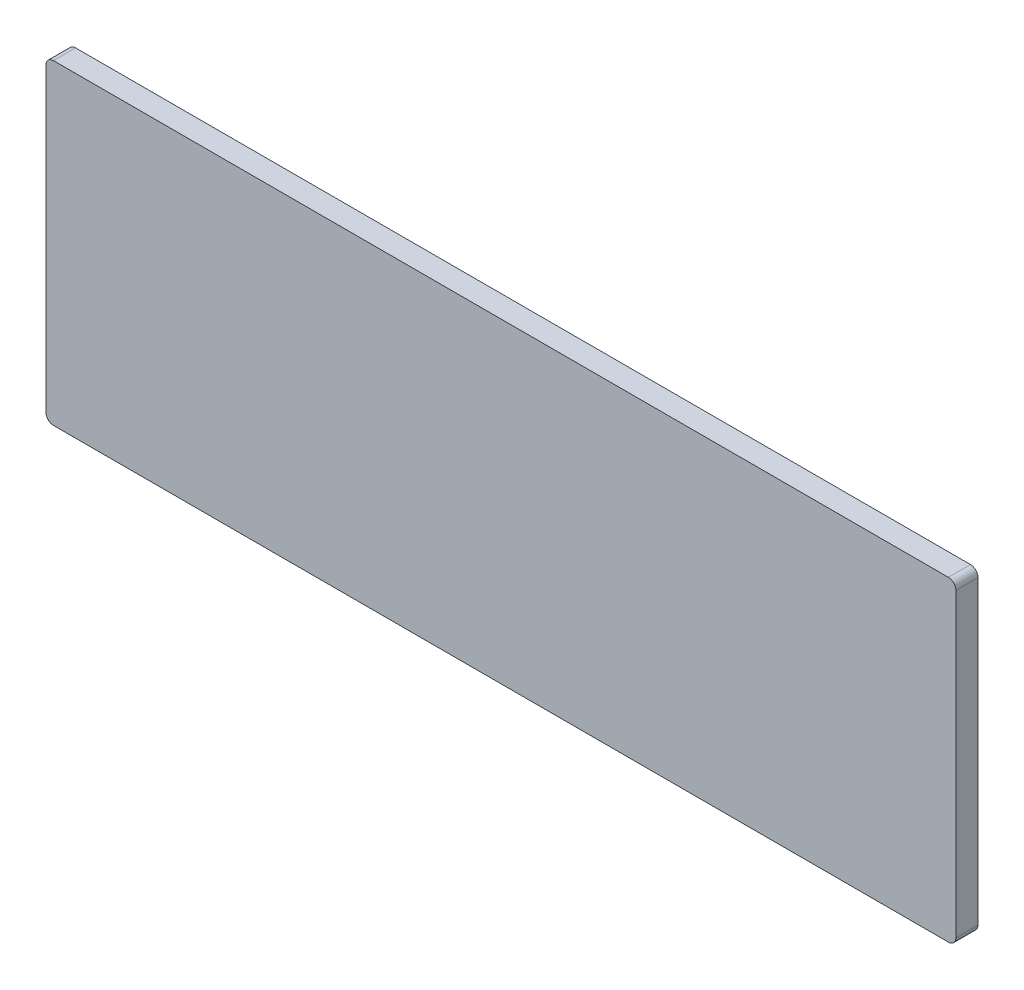
ISO-10303-21;
HEADER;
FILE_DESCRIPTION(('STEP AP214'),'2;1');
FILE_NAME('part.step','',(''),(''),'','','');
FILE_SCHEMA(('AUTOMOTIVE_DESIGN { 1 0 10303 214 1 1 1 1 }'));
ENDSEC;
DATA;
#1=APPLICATION_CONTEXT('core data for automotive mechanical design processes');
#2=APPLICATION_PROTOCOL_DEFINITION('international standard','automotive_design',2000,#1);
#3=PRODUCT_CONTEXT('',#1,'mechanical');
#4=PRODUCT('Part','Part','',(#3));
#5=PRODUCT_RELATED_PRODUCT_CATEGORY('part','',(#4));
#6=PRODUCT_DEFINITION_FORMATION('','',#4);
#7=PRODUCT_DEFINITION_CONTEXT('part definition',#1,'design');
#8=PRODUCT_DEFINITION('design','',#6,#7);
#9=PRODUCT_DEFINITION_SHAPE('','',#8);
#10=(LENGTH_UNIT() NAMED_UNIT(*) SI_UNIT(.MILLI.,.METRE.));
#11=(NAMED_UNIT(*) PLANE_ANGLE_UNIT() SI_UNIT($,.RADIAN.));
#12=(NAMED_UNIT(*) SI_UNIT($,.STERADIAN.) SOLID_ANGLE_UNIT());
#13=UNCERTAINTY_MEASURE_WITH_UNIT(LENGTH_MEASURE(1.E-05),#10,'distance_accuracy_value','');
#14=(GEOMETRIC_REPRESENTATION_CONTEXT(3) GLOBAL_UNCERTAINTY_ASSIGNED_CONTEXT((#13)) GLOBAL_UNIT_ASSIGNED_CONTEXT((#10,
#11,#12)) REPRESENTATION_CONTEXT('',''));
#15=CARTESIAN_POINT('',(0.,0.,0.));
#16=DIRECTION('',(0.,0.,1.));
#17=DIRECTION('',(1.,0.,0.));
#18=AXIS2_PLACEMENT_3D('',#15,#16,#17);
#19=CARTESIAN_POINT('',(-914.4,317.5,-44.45));
#20=DIRECTION('',(-1.,0.,0.));
#21=DIRECTION('',(0.,-1.,0.));
#22=AXIS2_PLACEMENT_3D('',#19,#20,#21);
#23=PLANE('',#22);
#24=DIRECTION('',(0.,-1.,0.));
#25=VECTOR('',#24,1.);
#26=CARTESIAN_POINT('',(-914.4,317.5,0.));
#27=LINE('',#26,#25);
#28=CARTESIAN_POINT('',(-914.4,302.5,0.));
#29=VERTEX_POINT('',#28);
#30=CARTESIAN_POINT('',(-914.4,-302.5,0.));
#31=VERTEX_POINT('',#30);
#32=EDGE_CURVE('E104',#29,#31,#27,.T.);
#33=ORIENTED_EDGE('',*,*,#32,.F.);
#34=DIRECTION('',(0.,0.,1.));
#35=VECTOR('',#34,1.);
#36=CARTESIAN_POINT('',(-914.4,302.5,-44.45));
#37=LINE('',#36,#35);
#38=CARTESIAN_POINT('',(-914.4,302.5,-44.45));
#39=VERTEX_POINT('',#38);
#40=EDGE_CURVE('E11',#29,#39,#37,.F.);
#41=ORIENTED_EDGE('',*,*,#40,.T.);
#42=DIRECTION('',(0.,-1.,0.));
#43=VECTOR('',#42,1.);
#44=CARTESIAN_POINT('',(-914.4,317.5,-44.45));
#45=LINE('',#44,#43);
#46=CARTESIAN_POINT('',(-914.4,-302.5,-44.45));
#47=VERTEX_POINT('',#46);
#48=EDGE_CURVE('E154',#39,#47,#45,.T.);
#49=ORIENTED_EDGE('',*,*,#48,.T.);
#50=DIRECTION('',(0.,0.,1.));
#51=VECTOR('',#50,1.);
#52=CARTESIAN_POINT('',(-914.4,-302.5,-44.45));
#53=LINE('',#52,#51);
#54=EDGE_CURVE('E41',#47,#31,#53,.T.);
#55=ORIENTED_EDGE('',*,*,#54,.T.);
#56=EDGE_LOOP('',(#33,#41,#49,#55));
#57=FACE_BOUND('',#56,.T.);
#58=ADVANCED_FACE('F33',(#57),#23,.T.);
#59=CARTESIAN_POINT('',(914.4,317.5,-44.45));
#60=DIRECTION('',(0.,1.,0.));
#61=DIRECTION('',(-1.,0.,0.));
#62=AXIS2_PLACEMENT_3D('',#59,#60,#61);
#63=PLANE('',#62);
#64=DIRECTION('',(-1.,0.,0.));
#65=VECTOR('',#64,1.);
#66=CARTESIAN_POINT('',(914.4,317.5,0.));
#67=LINE('',#66,#65);
#68=CARTESIAN_POINT('',(899.4,317.5,0.));
#69=VERTEX_POINT('',#68);
#70=CARTESIAN_POINT('',(-899.4,317.5,0.));
#71=VERTEX_POINT('',#70);
#72=EDGE_CURVE('E129',#69,#71,#67,.T.);
#73=ORIENTED_EDGE('',*,*,#72,.F.);
#74=DIRECTION('',(0.,0.,1.));
#75=VECTOR('',#74,1.);
#76=CARTESIAN_POINT('',(899.4,317.5,-44.45));
#77=LINE('',#76,#75);
#78=CARTESIAN_POINT('',(899.4,317.5,-44.45));
#79=VERTEX_POINT('',#78);
#80=EDGE_CURVE('E55',#69,#79,#77,.F.);
#81=ORIENTED_EDGE('',*,*,#80,.T.);
#82=DIRECTION('',(-1.,0.,0.));
#83=VECTOR('',#82,1.);
#84=CARTESIAN_POINT('',(914.4,317.5,-44.45));
#85=LINE('',#84,#83);
#86=CARTESIAN_POINT('',(-899.4,317.5,-44.45));
#87=VERTEX_POINT('',#86);
#88=EDGE_CURVE('E123',#79,#87,#85,.T.);
#89=ORIENTED_EDGE('',*,*,#88,.T.);
#90=DIRECTION('',(0.,0.,1.));
#91=VECTOR('',#90,1.);
#92=CARTESIAN_POINT('',(-899.4,317.5,-44.45));
#93=LINE('',#92,#91);
#94=EDGE_CURVE('E148',#87,#71,#93,.T.);
#95=ORIENTED_EDGE('',*,*,#94,.T.);
#96=EDGE_LOOP('',(#73,#81,#89,#95));
#97=FACE_BOUND('',#96,.T.);
#98=ADVANCED_FACE('F186',(#97),#63,.T.);
#99=CARTESIAN_POINT('',(914.4,317.5,-44.45));
#100=DIRECTION('',(1.,0.,0.));
#101=DIRECTION('',(0.,1.,0.));
#102=AXIS2_PLACEMENT_3D('',#99,#100,#101);
#103=PLANE('',#102);
#104=DIRECTION('',(0.,1.,0.));
#105=VECTOR('',#104,1.);
#106=CARTESIAN_POINT('',(914.4,317.5,0.));
#107=LINE('',#106,#105);
#108=CARTESIAN_POINT('',(914.4,-302.5,0.));
#109=VERTEX_POINT('',#108);
#110=CARTESIAN_POINT('',(914.4,302.5,0.));
#111=VERTEX_POINT('',#110);
#112=EDGE_CURVE('E119',#109,#111,#107,.T.);
#113=ORIENTED_EDGE('',*,*,#112,.F.);
#114=DIRECTION('',(0.,0.,1.));
#115=VECTOR('',#114,1.);
#116=CARTESIAN_POINT('',(914.4,-302.5,-44.45));
#117=LINE('',#116,#115);
#118=CARTESIAN_POINT('',(914.4,-302.5,-44.45));
#119=VERTEX_POINT('',#118);
#120=EDGE_CURVE('E140',#109,#119,#117,.F.);
#121=ORIENTED_EDGE('',*,*,#120,.T.);
#122=DIRECTION('',(0.,1.,0.));
#123=VECTOR('',#122,1.);
#124=CARTESIAN_POINT('',(914.4,317.5,-44.45));
#125=LINE('',#124,#123);
#126=CARTESIAN_POINT('',(914.4,302.5,-44.45));
#127=VERTEX_POINT('',#126);
#128=EDGE_CURVE('E126',#119,#127,#125,.T.);
#129=ORIENTED_EDGE('',*,*,#128,.T.);
#130=DIRECTION('',(0.,0.,1.));
#131=VECTOR('',#130,1.);
#132=CARTESIAN_POINT('',(914.4,302.5,-44.45));
#133=LINE('',#132,#131);
#134=EDGE_CURVE('E137',#127,#111,#133,.T.);
#135=ORIENTED_EDGE('',*,*,#134,.T.);
#136=EDGE_LOOP('',(#113,#121,#129,#135));
#137=FACE_BOUND('',#136,.T.);
#138=ADVANCED_FACE('F166',(#137),#103,.T.);
#139=CARTESIAN_POINT('',(914.4,-317.5,-44.45));
#140=DIRECTION('',(0.,-1.,0.));
#141=DIRECTION('',(1.,0.,0.));
#142=AXIS2_PLACEMENT_3D('',#139,#140,#141);
#143=PLANE('',#142);
#144=DIRECTION('',(1.,0.,0.));
#145=VECTOR('',#144,1.);
#146=CARTESIAN_POINT('',(914.4,-317.5,-44.45));
#147=LINE('',#146,#145);
#148=CARTESIAN_POINT('',(-899.4,-317.5,-44.45));
#149=VERTEX_POINT('',#148);
#150=CARTESIAN_POINT('',(899.4,-317.5,-44.45));
#151=VERTEX_POINT('',#150);
#152=EDGE_CURVE('E155',#149,#151,#147,.T.);
#153=ORIENTED_EDGE('',*,*,#152,.T.);
#154=DIRECTION('',(0.,0.,1.));
#155=VECTOR('',#154,1.);
#156=CARTESIAN_POINT('',(899.4,-317.5,-44.45));
#157=LINE('',#156,#155);
#158=CARTESIAN_POINT('',(899.4,-317.5,0.));
#159=VERTEX_POINT('',#158);
#160=EDGE_CURVE('E110',#151,#159,#157,.T.);
#161=ORIENTED_EDGE('',*,*,#160,.T.);
#162=DIRECTION('',(1.,0.,0.));
#163=VECTOR('',#162,1.);
#164=CARTESIAN_POINT('',(914.4,-317.5,0.));
#165=LINE('',#164,#163);
#166=CARTESIAN_POINT('',(-899.4,-317.5,0.));
#167=VERTEX_POINT('',#166);
#168=EDGE_CURVE('E102',#167,#159,#165,.T.);
#169=ORIENTED_EDGE('',*,*,#168,.F.);
#170=DIRECTION('',(0.,0.,1.));
#171=VECTOR('',#170,1.);
#172=CARTESIAN_POINT('',(-899.4,-317.5,-44.45));
#173=LINE('',#172,#171);
#174=EDGE_CURVE('E116',#167,#149,#173,.F.);
#175=ORIENTED_EDGE('',*,*,#174,.T.);
#176=EDGE_LOOP('',(#153,#161,#169,#175));
#177=FACE_BOUND('',#176,.T.);
#178=ADVANCED_FACE('F115',(#177),#143,.T.);
#179=CARTESIAN_POINT('',(0.,0.,-44.45));
#180=DIRECTION('',(0.,0.,-1.));
#181=DIRECTION('',(-1.,0.,0.));
#182=AXIS2_PLACEMENT_3D('',#179,#180,#181);
#183=PLANE('',#182);
#184=ORIENTED_EDGE('',*,*,#128,.F.);
#185=CARTESIAN_POINT('',(899.4,-302.5,-44.45));
#186=DIRECTION('',(0.,0.,-1.));
#187=DIRECTION('',(-1.,0.,0.));
#188=AXIS2_PLACEMENT_3D('',#185,#186,#187);
#189=CIRCLE('',#188,15.);
#190=EDGE_CURVE('E146',#119,#151,#189,.T.);
#191=ORIENTED_EDGE('',*,*,#190,.T.);
#192=ORIENTED_EDGE('',*,*,#152,.F.);
#193=CARTESIAN_POINT('',(-899.4,-302.5,-44.45));
#194=DIRECTION('',(0.,0.,-1.));
#195=DIRECTION('',(-1.,0.,0.));
#196=AXIS2_PLACEMENT_3D('',#193,#194,#195);
#197=CIRCLE('',#196,15.);
#198=EDGE_CURVE('E122',#149,#47,#197,.T.);
#199=ORIENTED_EDGE('',*,*,#198,.T.);
#200=ORIENTED_EDGE('',*,*,#48,.F.);
#201=CARTESIAN_POINT('',(-899.4,302.5,-44.45));
#202=DIRECTION('',(0.,0.,-1.));
#203=DIRECTION('',(-1.,0.,0.));
#204=AXIS2_PLACEMENT_3D('',#201,#202,#203);
#205=CIRCLE('',#204,15.);
#206=EDGE_CURVE('E48',#39,#87,#205,.T.);
#207=ORIENTED_EDGE('',*,*,#206,.T.);
#208=ORIENTED_EDGE('',*,*,#88,.F.);
#209=CARTESIAN_POINT('',(899.4,302.5,-44.45));
#210=DIRECTION('',(0.,0.,-1.));
#211=DIRECTION('',(-1.,0.,0.));
#212=AXIS2_PLACEMENT_3D('',#209,#210,#211);
#213=CIRCLE('',#212,15.);
#214=EDGE_CURVE('E144',#79,#127,#213,.T.);
#215=ORIENTED_EDGE('',*,*,#214,.T.);
#216=EDGE_LOOP('',(#184,#191,#192,#199,#200,#207,#208,#215));
#217=FACE_BOUND('',#216,.T.);
#218=ADVANCED_FACE('F172',(#217),#183,.T.);
#219=CARTESIAN_POINT('',(0.,0.,0.));
#220=DIRECTION('',(0.,0.,-1.));
#221=DIRECTION('',(-1.,0.,0.));
#222=AXIS2_PLACEMENT_3D('',#219,#220,#221);
#223=PLANE('',#222);
#224=ORIENTED_EDGE('',*,*,#168,.T.);
#225=CARTESIAN_POINT('',(899.4,-302.5,0.));
#226=DIRECTION('',(0.,0.,-1.));
#227=DIRECTION('',(-1.,0.,0.));
#228=AXIS2_PLACEMENT_3D('',#225,#226,#227);
#229=CIRCLE('',#228,15.);
#230=EDGE_CURVE('E135',#159,#109,#229,.F.);
#231=ORIENTED_EDGE('',*,*,#230,.T.);
#232=ORIENTED_EDGE('',*,*,#112,.T.);
#233=CARTESIAN_POINT('',(899.4,302.5,0.));
#234=DIRECTION('',(0.,0.,-1.));
#235=DIRECTION('',(-1.,0.,0.));
#236=AXIS2_PLACEMENT_3D('',#233,#234,#235);
#237=CIRCLE('',#236,15.);
#238=EDGE_CURVE('E133',#111,#69,#237,.F.);
#239=ORIENTED_EDGE('',*,*,#238,.T.);
#240=ORIENTED_EDGE('',*,*,#72,.T.);
#241=CARTESIAN_POINT('',(-899.4,302.5,0.));
#242=DIRECTION('',(0.,0.,-1.));
#243=DIRECTION('',(-1.,0.,0.));
#244=AXIS2_PLACEMENT_3D('',#241,#242,#243);
#245=CIRCLE('',#244,15.);
#246=EDGE_CURVE('E109',#71,#29,#245,.F.);
#247=ORIENTED_EDGE('',*,*,#246,.T.);
#248=ORIENTED_EDGE('',*,*,#32,.T.);
#249=CARTESIAN_POINT('',(-899.4,-302.5,0.));
#250=DIRECTION('',(0.,0.,-1.));
#251=DIRECTION('',(-1.,0.,0.));
#252=AXIS2_PLACEMENT_3D('',#249,#250,#251);
#253=CIRCLE('',#252,15.);
#254=EDGE_CURVE('E99',#31,#167,#253,.F.);
#255=ORIENTED_EDGE('',*,*,#254,.T.);
#256=EDGE_LOOP('',(#224,#231,#232,#239,#240,#247,#248,#255));
#257=FACE_BOUND('',#256,.T.);
#258=ADVANCED_FACE('F101',(#257),#223,.F.);
#259=CARTESIAN_POINT('',(899.4,-302.5,-44.45));
#260=DIRECTION('',(0.,0.,1.));
#261=DIRECTION('',(1.,0.,0.));
#262=AXIS2_PLACEMENT_3D('',#259,#260,#261);
#263=CYLINDRICAL_SURFACE('',#262,15.);
#264=ORIENTED_EDGE('',*,*,#190,.F.);
#265=ORIENTED_EDGE('',*,*,#120,.F.);
#266=ORIENTED_EDGE('',*,*,#230,.F.);
#267=ORIENTED_EDGE('',*,*,#160,.F.);
#268=EDGE_LOOP('',(#264,#265,#266,#267));
#269=FACE_BOUND('',#268,.T.);
#270=ADVANCED_FACE('F171',(#269),#263,.T.);
#271=CARTESIAN_POINT('',(899.4,302.5,-44.45));
#272=DIRECTION('',(0.,0.,1.));
#273=DIRECTION('',(1.,0.,0.));
#274=AXIS2_PLACEMENT_3D('',#271,#272,#273);
#275=CYLINDRICAL_SURFACE('',#274,15.);
#276=ORIENTED_EDGE('',*,*,#214,.F.);
#277=ORIENTED_EDGE('',*,*,#80,.F.);
#278=ORIENTED_EDGE('',*,*,#238,.F.);
#279=ORIENTED_EDGE('',*,*,#134,.F.);
#280=EDGE_LOOP('',(#276,#277,#278,#279));
#281=FACE_BOUND('',#280,.T.);
#282=ADVANCED_FACE('F175',(#281),#275,.T.);
#283=CARTESIAN_POINT('',(-899.4,302.5,-44.45));
#284=DIRECTION('',(0.,0.,1.));
#285=DIRECTION('',(1.,0.,0.));
#286=AXIS2_PLACEMENT_3D('',#283,#284,#285);
#287=CYLINDRICAL_SURFACE('',#286,15.);
#288=ORIENTED_EDGE('',*,*,#206,.F.);
#289=ORIENTED_EDGE('',*,*,#40,.F.);
#290=ORIENTED_EDGE('',*,*,#246,.F.);
#291=ORIENTED_EDGE('',*,*,#94,.F.);
#292=EDGE_LOOP('',(#288,#289,#290,#291));
#293=FACE_BOUND('',#292,.T.);
#294=ADVANCED_FACE('F177',(#293),#287,.T.);
#295=CARTESIAN_POINT('',(-899.4,-302.5,-44.45));
#296=DIRECTION('',(0.,0.,1.));
#297=DIRECTION('',(1.,0.,0.));
#298=AXIS2_PLACEMENT_3D('',#295,#296,#297);
#299=CYLINDRICAL_SURFACE('',#298,15.);
#300=ORIENTED_EDGE('',*,*,#198,.F.);
#301=ORIENTED_EDGE('',*,*,#174,.F.);
#302=ORIENTED_EDGE('',*,*,#254,.F.);
#303=ORIENTED_EDGE('',*,*,#54,.F.);
#304=EDGE_LOOP('',(#300,#301,#302,#303));
#305=FACE_BOUND('',#304,.T.);
#306=ADVANCED_FACE('F35',(#305),#299,.T.);
#307=CLOSED_SHELL('',(#58,#98,#138,#178,#218,#258,#270,#282,#294,#306));
#308=MANIFOLD_SOLID_BREP('B2',#307);
#309=ADVANCED_BREP_SHAPE_REPRESENTATION('',(#18,#308),#14);
#310=SHAPE_DEFINITION_REPRESENTATION(#9,#309);
ENDSEC;
END-ISO-10303-21;
